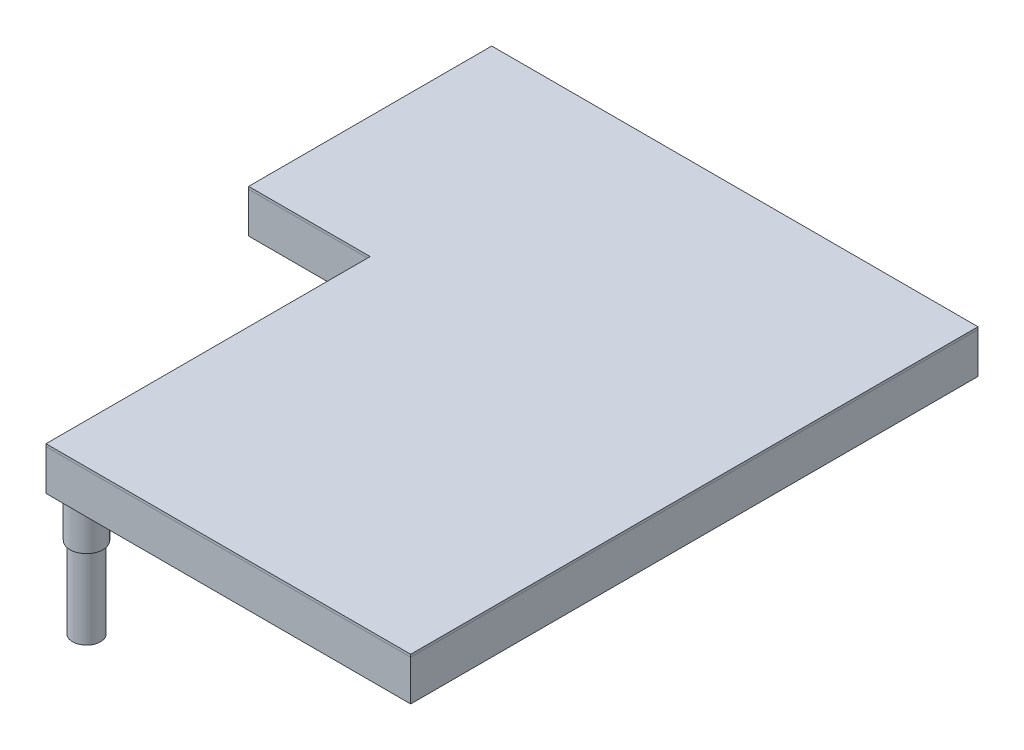
ISO-10303-21;
HEADER;
FILE_DESCRIPTION(('STEP AP214'),'2;1');
FILE_NAME('part.step','',(''),(''),'','','');
FILE_SCHEMA(('AUTOMOTIVE_DESIGN { 1 0 10303 214 1 1 1 1 }'));
ENDSEC;
DATA;
#1=APPLICATION_CONTEXT('core data for automotive mechanical design processes');
#2=APPLICATION_PROTOCOL_DEFINITION('international standard','automotive_design',2000,#1);
#3=PRODUCT_CONTEXT('',#1,'mechanical');
#4=PRODUCT('Part','Part','',(#3));
#5=PRODUCT_RELATED_PRODUCT_CATEGORY('part','',(#4));
#6=PRODUCT_DEFINITION_FORMATION('','',#4);
#7=PRODUCT_DEFINITION_CONTEXT('part definition',#1,'design');
#8=PRODUCT_DEFINITION('design','',#6,#7);
#9=PRODUCT_DEFINITION_SHAPE('','',#8);
#10=(LENGTH_UNIT() NAMED_UNIT(*) SI_UNIT(.MILLI.,.METRE.));
#11=(NAMED_UNIT(*) PLANE_ANGLE_UNIT() SI_UNIT($,.RADIAN.));
#12=(NAMED_UNIT(*) SI_UNIT($,.STERADIAN.) SOLID_ANGLE_UNIT());
#13=UNCERTAINTY_MEASURE_WITH_UNIT(LENGTH_MEASURE(1.E-05),#10,'distance_accuracy_value','');
#14=(GEOMETRIC_REPRESENTATION_CONTEXT(3) GLOBAL_UNCERTAINTY_ASSIGNED_CONTEXT((#13)) GLOBAL_UNIT_ASSIGNED_CONTEXT((#10,
#11,#12)) REPRESENTATION_CONTEXT('',''));
#15=CARTESIAN_POINT('',(0.,0.,0.));
#16=DIRECTION('',(0.,0.,1.));
#17=DIRECTION('',(1.,0.,0.));
#18=AXIS2_PLACEMENT_3D('',#15,#16,#17);
#19=CARTESIAN_POINT('',(25.4,-103.1875,-25.4));
#20=DIRECTION('',(0.,-1.,0.));
#21=DIRECTION('',(0.,0.,-1.));
#22=AXIS2_PLACEMENT_3D('',#19,#20,#21);
#23=PLANE('',#22);
#24=CARTESIAN_POINT('',(25.4,-103.1875,-25.4));
#25=DIRECTION('',(0.,-1.,0.));
#26=DIRECTION('',(0.,0.,-1.));
#27=AXIS2_PLACEMENT_3D('',#24,#25,#26);
#28=CIRCLE('',#27,20.6375);
#29=CARTESIAN_POINT('',(25.4,-103.1875,-46.0375));
#30=VERTEX_POINT('',#29);
#31=EDGE_CURVE('E11',#30,#30,#28,.T.);
#32=ORIENTED_EDGE('',*,*,#31,.T.);
#33=EDGE_LOOP('',(#32));
#34=FACE_BOUND('',#33,.T.);
#35=CARTESIAN_POINT('',(25.4,-103.1875,-25.4));
#36=DIRECTION('',(0.,-1.,0.));
#37=DIRECTION('',(0.,0.,-1.));
#38=AXIS2_PLACEMENT_3D('',#35,#36,#37);
#39=CIRCLE('',#38,17.4625);
#40=CARTESIAN_POINT('',(25.4,-103.1875,-42.8625));
#41=VERTEX_POINT('',#40);
#42=EDGE_CURVE('E53',#41,#41,#39,.T.);
#43=ORIENTED_EDGE('',*,*,#42,.F.);
#44=EDGE_LOOP('',(#43));
#45=FACE_BOUND('',#44,.T.);
#46=ADVANCED_FACE('F42',(#34,#45),#23,.T.);
#47=CARTESIAN_POINT('',(25.4,-52.3875,-25.4));
#48=DIRECTION('',(0.,-1.,0.));
#49=DIRECTION('',(0.,0.,-1.));
#50=AXIS2_PLACEMENT_3D('',#47,#48,#49);
#51=PLANE('',#50);
#52=CARTESIAN_POINT('',(25.4,-52.3875,-25.4));
#53=DIRECTION('',(0.,-1.,0.));
#54=DIRECTION('',(0.,0.,-1.));
#55=AXIS2_PLACEMENT_3D('',#52,#53,#54);
#56=CIRCLE('',#55,20.6375);
#57=CARTESIAN_POINT('',(25.4,-52.3875,-46.0375));
#58=VERTEX_POINT('',#57);
#59=EDGE_CURVE('E46',#58,#58,#56,.T.);
#60=ORIENTED_EDGE('',*,*,#59,.F.);
#61=EDGE_LOOP('',(#60));
#62=FACE_BOUND('',#61,.T.);
#63=CARTESIAN_POINT('',(25.4,-52.3875,-25.4));
#64=DIRECTION('',(0.,-1.,0.));
#65=DIRECTION('',(0.,0.,-1.));
#66=AXIS2_PLACEMENT_3D('',#63,#64,#65);
#67=CIRCLE('',#66,17.4625);
#68=CARTESIAN_POINT('',(25.4,-52.3875,-42.8625));
#69=VERTEX_POINT('',#68);
#70=EDGE_CURVE('E55',#69,#69,#67,.T.);
#71=ORIENTED_EDGE('',*,*,#70,.T.);
#72=EDGE_LOOP('',(#71));
#73=FACE_BOUND('',#72,.T.);
#74=ADVANCED_FACE('F65',(#62,#73),#51,.F.);
#75=CARTESIAN_POINT('',(25.4,-103.1875,-25.4));
#76=DIRECTION('',(0.,1.,0.));
#77=DIRECTION('',(0.,0.,1.));
#78=AXIS2_PLACEMENT_3D('',#75,#76,#77);
#79=CYLINDRICAL_SURFACE('',#78,20.6375);
#80=ORIENTED_EDGE('',*,*,#31,.F.);
#81=EDGE_LOOP('',(#80));
#82=FACE_BOUND('',#81,.T.);
#83=ORIENTED_EDGE('',*,*,#59,.T.);
#84=EDGE_LOOP('',(#83));
#85=FACE_BOUND('',#84,.T.);
#86=ADVANCED_FACE('F44',(#82,#85),#79,.T.);
#87=CARTESIAN_POINT('',(25.4,-103.1875,-25.4));
#88=DIRECTION('',(0.,1.,0.));
#89=DIRECTION('',(0.,0.,1.));
#90=AXIS2_PLACEMENT_3D('',#87,#88,#89);
#91=CYLINDRICAL_SURFACE('',#90,17.4625);
#92=ORIENTED_EDGE('',*,*,#42,.T.);
#93=EDGE_LOOP('',(#92));
#94=FACE_BOUND('',#93,.T.);
#95=ORIENTED_EDGE('',*,*,#70,.F.);
#96=EDGE_LOOP('',(#95));
#97=FACE_BOUND('',#96,.T.);
#98=ADVANCED_FACE('F61',(#94,#97),#91,.F.);
#99=CLOSED_SHELL('',(#46,#74,#86,#98));
#100=MANIFOLD_SOLID_BREP('B2',#99);
#101=CARTESIAN_POINT('',(0.,-52.3875,0.));
#102=DIRECTION('',(0.,-1.,0.));
#103=DIRECTION('',(0.,0.,-1.));
#104=AXIS2_PLACEMENT_3D('',#101,#102,#103);
#105=PLANE('',#104);
#106=DIRECTION('',(-1.,0.,0.));
#107=VECTOR('',#106,1.);
#108=CARTESIAN_POINT('',(406.4,-52.3875,-50.8));
#109=LINE('',#108,#107);
#110=CARTESIAN_POINT('',(406.4,-52.3875,-50.8));
#111=VERTEX_POINT('',#110);
#112=CARTESIAN_POINT('',(50.8,-52.3875,-50.8));
#113=VERTEX_POINT('',#112);
#114=EDGE_CURVE('E210',#111,#113,#109,.T.);
#115=ORIENTED_EDGE('',*,*,#114,.F.);
#116=DIRECTION('',(0.,0.,1.));
#117=VECTOR('',#116,1.);
#118=CARTESIAN_POINT('',(406.4,-52.3875,-660.4));
#119=LINE('',#118,#117);
#120=CARTESIAN_POINT('',(406.4,-52.3875,-660.4));
#121=VERTEX_POINT('',#120);
#122=EDGE_CURVE('E202',#121,#111,#119,.T.);
#123=ORIENTED_EDGE('',*,*,#122,.F.);
#124=DIRECTION('',(1.,0.,0.));
#125=VECTOR('',#124,1.);
#126=CARTESIAN_POINT('',(-101.6,-52.3875,-660.4));
#127=LINE('',#126,#125);
#128=CARTESIAN_POINT('',(-101.6,-52.3875,-660.4));
#129=VERTEX_POINT('',#128);
#130=EDGE_CURVE('E233',#129,#121,#127,.T.);
#131=ORIENTED_EDGE('',*,*,#130,.F.);
#132=DIRECTION('',(0.,0.,-1.));
#133=VECTOR('',#132,1.);
#134=CARTESIAN_POINT('',(-101.6,-52.3875,-457.2));
#135=LINE('',#134,#133);
#136=CARTESIAN_POINT('',(-101.6,-52.3875,-457.2));
#137=VERTEX_POINT('',#136);
#138=EDGE_CURVE('E231',#137,#129,#135,.T.);
#139=ORIENTED_EDGE('',*,*,#138,.F.);
#140=DIRECTION('',(-1.,0.,0.));
#141=VECTOR('',#140,1.);
#142=CARTESIAN_POINT('',(50.8000000000001,-52.3875,-457.2));
#143=LINE('',#142,#141);
#144=CARTESIAN_POINT('',(50.8000000000001,-52.3875,-457.2));
#145=VERTEX_POINT('',#144);
#146=EDGE_CURVE('E226',#145,#137,#143,.T.);
#147=ORIENTED_EDGE('',*,*,#146,.F.);
#148=DIRECTION('',(0.,0.,-1.));
#149=VECTOR('',#148,1.);
#150=CARTESIAN_POINT('',(50.8,-52.3875,-50.8));
#151=LINE('',#150,#149);
#152=EDGE_CURVE('E224',#113,#145,#151,.T.);
#153=ORIENTED_EDGE('',*,*,#152,.F.);
#154=EDGE_LOOP('',(#115,#123,#131,#139,#147,#153));
#155=FACE_BOUND('',#154,.T.);
#156=DIRECTION('',(0.,0.,1.));
#157=VECTOR('',#156,1.);
#158=CARTESIAN_POINT('',(457.2,-52.3875,-711.2));
#159=LINE('',#158,#157);
#160=CARTESIAN_POINT('',(457.2,-52.3875,-711.2));
#161=VERTEX_POINT('',#160);
#162=CARTESIAN_POINT('',(457.2,-52.3875,0.));
#163=VERTEX_POINT('',#162);
#164=EDGE_CURVE('E256',#161,#163,#159,.T.);
#165=ORIENTED_EDGE('',*,*,#164,.T.);
#166=DIRECTION('',(-1.,0.,0.));
#167=VECTOR('',#166,1.);
#168=CARTESIAN_POINT('',(457.2,-52.3875,0.));
#169=LINE('',#168,#167);
#170=CARTESIAN_POINT('',(0.,-52.3875,0.));
#171=VERTEX_POINT('',#170);
#172=EDGE_CURVE('E259',#163,#171,#169,.T.);
#173=ORIENTED_EDGE('',*,*,#172,.T.);
#174=DIRECTION('',(0.,0.,-1.));
#175=VECTOR('',#174,1.);
#176=CARTESIAN_POINT('',(0.,-52.3875,0.));
#177=LINE('',#176,#175);
#178=CARTESIAN_POINT('',(0.,-52.3875,-406.4));
#179=VERTEX_POINT('',#178);
#180=EDGE_CURVE('E262',#171,#179,#177,.T.);
#181=ORIENTED_EDGE('',*,*,#180,.T.);
#182=DIRECTION('',(-1.,0.,0.));
#183=VECTOR('',#182,1.);
#184=CARTESIAN_POINT('',(0.,-52.3875,-406.4));
#185=LINE('',#184,#183);
#186=CARTESIAN_POINT('',(-152.4,-52.3875,-406.4));
#187=VERTEX_POINT('',#186);
#188=EDGE_CURVE('E264',#179,#187,#185,.T.);
#189=ORIENTED_EDGE('',*,*,#188,.T.);
#190=DIRECTION('',(0.,0.,-1.));
#191=VECTOR('',#190,1.);
#192=CARTESIAN_POINT('',(-152.4,-52.3875,-406.4));
#193=LINE('',#192,#191);
#194=CARTESIAN_POINT('',(-152.4,-52.3875,-711.2));
#195=VERTEX_POINT('',#194);
#196=EDGE_CURVE('E266',#187,#195,#193,.T.);
#197=ORIENTED_EDGE('',*,*,#196,.T.);
#198=DIRECTION('',(1.,0.,0.));
#199=VECTOR('',#198,1.);
#200=CARTESIAN_POINT('',(-152.4,-52.3875,-711.2));
#201=LINE('',#200,#199);
#202=EDGE_CURVE('E268',#195,#161,#201,.T.);
#203=ORIENTED_EDGE('',*,*,#202,.T.);
#204=EDGE_LOOP('',(#165,#173,#181,#189,#197,#203));
#205=FACE_BOUND('',#204,.T.);
#206=CARTESIAN_POINT('',(25.4,-52.3875,-25.4));
#207=DIRECTION('',(0.,-1.,0.));
#208=DIRECTION('',(0.,0.,-1.));
#209=AXIS2_PLACEMENT_3D('',#206,#207,#208);
#210=CIRCLE('',#209,17.4625);
#211=CARTESIAN_POINT('',(25.4,-52.3875,-42.8625));
#212=VERTEX_POINT('',#211);
#213=EDGE_CURVE('E367',#212,#212,#210,.T.);
#214=ORIENTED_EDGE('',*,*,#213,.F.);
#215=EDGE_LOOP('',(#214));
#216=FACE_BOUND('',#215,.T.);
#217=ADVANCED_FACE('F113',(#155,#205,#216),#105,.T.);
#218=CARTESIAN_POINT('',(0.,-1.5875,0.));
#219=DIRECTION('',(0.,-1.,0.));
#220=DIRECTION('',(0.,0.,-1.));
#221=AXIS2_PLACEMENT_3D('',#218,#219,#220);
#222=PLANE('',#221);
#223=DIRECTION('',(0.,0.,1.));
#224=VECTOR('',#223,1.);
#225=CARTESIAN_POINT('',(457.2,-1.5875,-711.2));
#226=LINE('',#225,#224);
#227=CARTESIAN_POINT('',(457.2,-1.5875,-711.2));
#228=VERTEX_POINT('',#227);
#229=CARTESIAN_POINT('',(457.2,-1.5875,0.));
#230=VERTEX_POINT('',#229);
#231=EDGE_CURVE('E218',#228,#230,#226,.T.);
#232=ORIENTED_EDGE('',*,*,#231,.F.);
#233=DIRECTION('',(1.,0.,0.));
#234=VECTOR('',#233,1.);
#235=CARTESIAN_POINT('',(-152.4,-1.5875,-711.2));
#236=LINE('',#235,#234);
#237=CARTESIAN_POINT('',(-152.4,-1.5875,-711.2));
#238=VERTEX_POINT('',#237);
#239=EDGE_CURVE('E260',#238,#228,#236,.T.);
#240=ORIENTED_EDGE('',*,*,#239,.F.);
#241=DIRECTION('',(0.,0.,-1.));
#242=VECTOR('',#241,1.);
#243=CARTESIAN_POINT('',(-152.4,-1.5875,-406.4));
#244=LINE('',#243,#242);
#245=CARTESIAN_POINT('',(-152.4,-1.5875,-406.4));
#246=VERTEX_POINT('',#245);
#247=EDGE_CURVE('E279',#246,#238,#244,.T.);
#248=ORIENTED_EDGE('',*,*,#247,.F.);
#249=DIRECTION('',(-1.,0.,0.));
#250=VECTOR('',#249,1.);
#251=CARTESIAN_POINT('',(0.,-1.5875,-406.4));
#252=LINE('',#251,#250);
#253=CARTESIAN_POINT('',(0.,-1.5875,-406.4));
#254=VERTEX_POINT('',#253);
#255=EDGE_CURVE('E277',#254,#246,#252,.T.);
#256=ORIENTED_EDGE('',*,*,#255,.F.);
#257=DIRECTION('',(0.,0.,-1.));
#258=VECTOR('',#257,1.);
#259=CARTESIAN_POINT('',(0.,-1.5875,0.));
#260=LINE('',#259,#258);
#261=CARTESIAN_POINT('',(0.,-1.5875,0.));
#262=VERTEX_POINT('',#261);
#263=EDGE_CURVE('E275',#262,#254,#260,.T.);
#264=ORIENTED_EDGE('',*,*,#263,.F.);
#265=DIRECTION('',(-1.,0.,0.));
#266=VECTOR('',#265,1.);
#267=CARTESIAN_POINT('',(457.2,-1.5875,0.));
#268=LINE('',#267,#266);
#269=EDGE_CURVE('E273',#230,#262,#268,.T.);
#270=ORIENTED_EDGE('',*,*,#269,.F.);
#271=EDGE_LOOP('',(#232,#240,#248,#256,#264,#270));
#272=FACE_BOUND('',#271,.T.);
#273=DIRECTION('',(0.,0.,1.));
#274=VECTOR('',#273,1.);
#275=CARTESIAN_POINT('',(406.4,-1.5875,-660.4));
#276=LINE('',#275,#274);
#277=CARTESIAN_POINT('',(406.4,-1.5875,-660.4));
#278=VERTEX_POINT('',#277);
#279=CARTESIAN_POINT('',(406.4,-1.5875,-50.8));
#280=VERTEX_POINT('',#279);
#281=EDGE_CURVE('E136',#278,#280,#276,.T.);
#282=ORIENTED_EDGE('',*,*,#281,.T.);
#283=DIRECTION('',(-1.,0.,0.));
#284=VECTOR('',#283,1.);
#285=CARTESIAN_POINT('',(406.4,-1.5875,-50.8));
#286=LINE('',#285,#284);
#287=CARTESIAN_POINT('',(50.8,-1.5875,-50.8));
#288=VERTEX_POINT('',#287);
#289=EDGE_CURVE('E217',#280,#288,#286,.T.);
#290=ORIENTED_EDGE('',*,*,#289,.T.);
#291=DIRECTION('',(0.,0.,-1.));
#292=VECTOR('',#291,1.);
#293=CARTESIAN_POINT('',(50.8,-1.5875,-50.8));
#294=LINE('',#293,#292);
#295=CARTESIAN_POINT('',(50.8000000000001,-1.5875,-457.2));
#296=VERTEX_POINT('',#295);
#297=EDGE_CURVE('E238',#288,#296,#294,.T.);
#298=ORIENTED_EDGE('',*,*,#297,.T.);
#299=DIRECTION('',(-1.,0.,0.));
#300=VECTOR('',#299,1.);
#301=CARTESIAN_POINT('',(50.8000000000001,-1.5875,-457.2));
#302=LINE('',#301,#300);
#303=CARTESIAN_POINT('',(-101.6,-1.5875,-457.2));
#304=VERTEX_POINT('',#303);
#305=EDGE_CURVE('E241',#296,#304,#302,.T.);
#306=ORIENTED_EDGE('',*,*,#305,.T.);
#307=DIRECTION('',(0.,0.,-1.));
#308=VECTOR('',#307,1.);
#309=CARTESIAN_POINT('',(-101.6,-1.5875,-457.2));
#310=LINE('',#309,#308);
#311=CARTESIAN_POINT('',(-101.6,-1.5875,-660.4));
#312=VERTEX_POINT('',#311);
#313=EDGE_CURVE('E244',#304,#312,#310,.T.);
#314=ORIENTED_EDGE('',*,*,#313,.T.);
#315=DIRECTION('',(1.,0.,0.));
#316=VECTOR('',#315,1.);
#317=CARTESIAN_POINT('',(-101.6,-1.5875,-660.4));
#318=LINE('',#317,#316);
#319=EDGE_CURVE('E211',#312,#278,#318,.T.);
#320=ORIENTED_EDGE('',*,*,#319,.T.);
#321=EDGE_LOOP('',(#282,#290,#298,#306,#314,#320));
#322=FACE_BOUND('',#321,.T.);
#323=ADVANCED_FACE('F303',(#272,#322),#222,.F.);
#324=CARTESIAN_POINT('',(457.2,-52.3875,-711.2));
#325=DIRECTION('',(-1.,0.,0.));
#326=DIRECTION('',(0.,0.,1.));
#327=AXIS2_PLACEMENT_3D('',#324,#325,#326);
#328=PLANE('',#327);
#329=ORIENTED_EDGE('',*,*,#231,.T.);
#330=DIRECTION('',(0.,1.,0.));
#331=VECTOR('',#330,1.);
#332=CARTESIAN_POINT('',(457.2,-52.3875,0.));
#333=LINE('',#332,#331);
#334=EDGE_CURVE('E40',#163,#230,#333,.T.);
#335=ORIENTED_EDGE('',*,*,#334,.F.);
#336=ORIENTED_EDGE('',*,*,#164,.F.);
#337=DIRECTION('',(0.,1.,0.));
#338=VECTOR('',#337,1.);
#339=CARTESIAN_POINT('',(457.2,-52.3875,-711.2));
#340=LINE('',#339,#338);
#341=EDGE_CURVE('E270',#161,#228,#340,.T.);
#342=ORIENTED_EDGE('',*,*,#341,.T.);
#343=EDGE_LOOP('',(#329,#335,#336,#342));
#344=FACE_BOUND('',#343,.T.);
#345=ADVANCED_FACE('F115',(#344),#328,.F.);
#346=CARTESIAN_POINT('',(457.2,-52.3875,0.));
#347=DIRECTION('',(0.,0.,-1.));
#348=DIRECTION('',(-1.,0.,0.));
#349=AXIS2_PLACEMENT_3D('',#346,#347,#348);
#350=PLANE('',#349);
#351=ORIENTED_EDGE('',*,*,#269,.T.);
#352=DIRECTION('',(0.,1.,0.));
#353=VECTOR('',#352,1.);
#354=CARTESIAN_POINT('',(0.,-52.3875,0.));
#355=LINE('',#354,#353);
#356=EDGE_CURVE('E121',#171,#262,#355,.T.);
#357=ORIENTED_EDGE('',*,*,#356,.F.);
#358=ORIENTED_EDGE('',*,*,#172,.F.);
#359=ORIENTED_EDGE('',*,*,#334,.T.);
#360=EDGE_LOOP('',(#351,#357,#358,#359));
#361=FACE_BOUND('',#360,.T.);
#362=ADVANCED_FACE('F320',(#361),#350,.F.);
#363=CARTESIAN_POINT('',(0.,-52.3875,0.));
#364=DIRECTION('',(1.,0.,0.));
#365=DIRECTION('',(0.,0.,-1.));
#366=AXIS2_PLACEMENT_3D('',#363,#364,#365);
#367=PLANE('',#366);
#368=ORIENTED_EDGE('',*,*,#263,.T.);
#369=DIRECTION('',(0.,1.,0.));
#370=VECTOR('',#369,1.);
#371=CARTESIAN_POINT('',(0.,-52.3875,-406.4));
#372=LINE('',#371,#370);
#373=EDGE_CURVE('E290',#179,#254,#372,.T.);
#374=ORIENTED_EDGE('',*,*,#373,.F.);
#375=ORIENTED_EDGE('',*,*,#180,.F.);
#376=ORIENTED_EDGE('',*,*,#356,.T.);
#377=EDGE_LOOP('',(#368,#374,#375,#376));
#378=FACE_BOUND('',#377,.T.);
#379=ADVANCED_FACE('F297',(#378),#367,.F.);
#380=CARTESIAN_POINT('',(0.,-52.3875,-406.4));
#381=DIRECTION('',(0.,0.,-1.));
#382=DIRECTION('',(-1.,0.,0.));
#383=AXIS2_PLACEMENT_3D('',#380,#381,#382);
#384=PLANE('',#383);
#385=ORIENTED_EDGE('',*,*,#255,.T.);
#386=DIRECTION('',(0.,1.,0.));
#387=VECTOR('',#386,1.);
#388=CARTESIAN_POINT('',(-152.4,-52.3875,-406.4));
#389=LINE('',#388,#387);
#390=EDGE_CURVE('E287',#187,#246,#389,.T.);
#391=ORIENTED_EDGE('',*,*,#390,.F.);
#392=ORIENTED_EDGE('',*,*,#188,.F.);
#393=ORIENTED_EDGE('',*,*,#373,.T.);
#394=EDGE_LOOP('',(#385,#391,#392,#393));
#395=FACE_BOUND('',#394,.T.);
#396=ADVANCED_FACE('F309',(#395),#384,.F.);
#397=CARTESIAN_POINT('',(-152.4,-52.3875,-406.4));
#398=DIRECTION('',(1.,0.,0.));
#399=DIRECTION('',(0.,0.,-1.));
#400=AXIS2_PLACEMENT_3D('',#397,#398,#399);
#401=PLANE('',#400);
#402=ORIENTED_EDGE('',*,*,#247,.T.);
#403=DIRECTION('',(0.,1.,0.));
#404=VECTOR('',#403,1.);
#405=CARTESIAN_POINT('',(-152.4,-52.3875,-711.2));
#406=LINE('',#405,#404);
#407=EDGE_CURVE('E284',#195,#238,#406,.T.);
#408=ORIENTED_EDGE('',*,*,#407,.F.);
#409=ORIENTED_EDGE('',*,*,#196,.F.);
#410=ORIENTED_EDGE('',*,*,#390,.T.);
#411=EDGE_LOOP('',(#402,#408,#409,#410));
#412=FACE_BOUND('',#411,.T.);
#413=ADVANCED_FACE('F313',(#412),#401,.F.);
#414=CARTESIAN_POINT('',(-152.4,-52.3875,-711.2));
#415=DIRECTION('',(0.,0.,1.));
#416=DIRECTION('',(1.,0.,0.));
#417=AXIS2_PLACEMENT_3D('',#414,#415,#416);
#418=PLANE('',#417);
#419=ORIENTED_EDGE('',*,*,#239,.T.);
#420=ORIENTED_EDGE('',*,*,#341,.F.);
#421=ORIENTED_EDGE('',*,*,#202,.F.);
#422=ORIENTED_EDGE('',*,*,#407,.T.);
#423=EDGE_LOOP('',(#419,#420,#421,#422));
#424=FACE_BOUND('',#423,.T.);
#425=ADVANCED_FACE('F323',(#424),#418,.F.);
#426=CARTESIAN_POINT('',(406.4,-52.3875,-660.4));
#427=DIRECTION('',(-1.,0.,0.));
#428=DIRECTION('',(0.,0.,1.));
#429=AXIS2_PLACEMENT_3D('',#426,#427,#428);
#430=PLANE('',#429);
#431=ORIENTED_EDGE('',*,*,#281,.F.);
#432=DIRECTION('',(0.,1.,0.));
#433=VECTOR('',#432,1.);
#434=CARTESIAN_POINT('',(406.4,-52.3875,-660.4));
#435=LINE('',#434,#433);
#436=EDGE_CURVE('E206',#121,#278,#435,.T.);
#437=ORIENTED_EDGE('',*,*,#436,.F.);
#438=ORIENTED_EDGE('',*,*,#122,.T.);
#439=DIRECTION('',(0.,1.,0.));
#440=VECTOR('',#439,1.);
#441=CARTESIAN_POINT('',(406.4,-52.3875,-50.8));
#442=LINE('',#441,#440);
#443=EDGE_CURVE('E205',#111,#280,#442,.T.);
#444=ORIENTED_EDGE('',*,*,#443,.T.);
#445=EDGE_LOOP('',(#431,#437,#438,#444));
#446=FACE_BOUND('',#445,.T.);
#447=ADVANCED_FACE('F204',(#446),#430,.T.);
#448=CARTESIAN_POINT('',(406.4,-52.3875,-50.8));
#449=DIRECTION('',(0.,0.,-1.));
#450=DIRECTION('',(-1.,0.,0.));
#451=AXIS2_PLACEMENT_3D('',#448,#449,#450);
#452=PLANE('',#451);
#453=ORIENTED_EDGE('',*,*,#289,.F.);
#454=ORIENTED_EDGE('',*,*,#443,.F.);
#455=ORIENTED_EDGE('',*,*,#114,.T.);
#456=DIRECTION('',(0.,1.,0.));
#457=VECTOR('',#456,1.);
#458=CARTESIAN_POINT('',(50.8,-52.3875,-50.8));
#459=LINE('',#458,#457);
#460=EDGE_CURVE('E219',#113,#288,#459,.T.);
#461=ORIENTED_EDGE('',*,*,#460,.T.);
#462=EDGE_LOOP('',(#453,#454,#455,#461));
#463=FACE_BOUND('',#462,.T.);
#464=ADVANCED_FACE('F214',(#463),#452,.T.);
#465=CARTESIAN_POINT('',(50.8,-52.3875,-50.8));
#466=DIRECTION('',(1.,0.,0.));
#467=DIRECTION('',(0.,0.,-1.));
#468=AXIS2_PLACEMENT_3D('',#465,#466,#467);
#469=PLANE('',#468);
#470=ORIENTED_EDGE('',*,*,#297,.F.);
#471=ORIENTED_EDGE('',*,*,#460,.F.);
#472=ORIENTED_EDGE('',*,*,#152,.T.);
#473=DIRECTION('',(0.,1.,0.));
#474=VECTOR('',#473,1.);
#475=CARTESIAN_POINT('',(50.8000000000001,-52.3875,-457.2));
#476=LINE('',#475,#474);
#477=EDGE_CURVE('E253',#145,#296,#476,.T.);
#478=ORIENTED_EDGE('',*,*,#477,.T.);
#479=EDGE_LOOP('',(#470,#471,#472,#478));
#480=FACE_BOUND('',#479,.T.);
#481=ADVANCED_FACE('F341',(#480),#469,.T.);
#482=CARTESIAN_POINT('',(50.8000000000001,-52.3875,-457.2));
#483=DIRECTION('',(0.,0.,-1.));
#484=DIRECTION('',(-1.,0.,0.));
#485=AXIS2_PLACEMENT_3D('',#482,#483,#484);
#486=PLANE('',#485);
#487=ORIENTED_EDGE('',*,*,#305,.F.);
#488=ORIENTED_EDGE('',*,*,#477,.F.);
#489=ORIENTED_EDGE('',*,*,#146,.T.);
#490=DIRECTION('',(0.,1.,0.));
#491=VECTOR('',#490,1.);
#492=CARTESIAN_POINT('',(-101.6,-52.3875,-457.2));
#493=LINE('',#492,#491);
#494=EDGE_CURVE('E251',#137,#304,#493,.T.);
#495=ORIENTED_EDGE('',*,*,#494,.T.);
#496=EDGE_LOOP('',(#487,#488,#489,#495));
#497=FACE_BOUND('',#496,.T.);
#498=ADVANCED_FACE('F344',(#497),#486,.T.);
#499=CARTESIAN_POINT('',(-101.6,-52.3875,-457.2));
#500=DIRECTION('',(1.,0.,0.));
#501=DIRECTION('',(0.,0.,-1.));
#502=AXIS2_PLACEMENT_3D('',#499,#500,#501);
#503=PLANE('',#502);
#504=ORIENTED_EDGE('',*,*,#313,.F.);
#505=ORIENTED_EDGE('',*,*,#494,.F.);
#506=ORIENTED_EDGE('',*,*,#138,.T.);
#507=DIRECTION('',(0.,1.,0.));
#508=VECTOR('',#507,1.);
#509=CARTESIAN_POINT('',(-101.6,-52.3875,-660.4));
#510=LINE('',#509,#508);
#511=EDGE_CURVE('E128',#129,#312,#510,.T.);
#512=ORIENTED_EDGE('',*,*,#511,.T.);
#513=EDGE_LOOP('',(#504,#505,#506,#512));
#514=FACE_BOUND('',#513,.T.);
#515=ADVANCED_FACE('F348',(#514),#503,.T.);
#516=CARTESIAN_POINT('',(-101.6,-52.3875,-660.4));
#517=DIRECTION('',(0.,0.,1.));
#518=DIRECTION('',(1.,0.,0.));
#519=AXIS2_PLACEMENT_3D('',#516,#517,#518);
#520=PLANE('',#519);
#521=ORIENTED_EDGE('',*,*,#319,.F.);
#522=ORIENTED_EDGE('',*,*,#511,.F.);
#523=ORIENTED_EDGE('',*,*,#130,.T.);
#524=ORIENTED_EDGE('',*,*,#436,.T.);
#525=EDGE_LOOP('',(#521,#522,#523,#524));
#526=FACE_BOUND('',#525,.T.);
#527=ADVANCED_FACE('F352',(#526),#520,.T.);
#528=CARTESIAN_POINT('',(25.4,-204.7875,-25.4));
#529=DIRECTION('',(0.,1.,0.));
#530=DIRECTION('',(0.,0.,1.));
#531=AXIS2_PLACEMENT_3D('',#528,#529,#530);
#532=CYLINDRICAL_SURFACE('',#531,17.4625);
#533=CARTESIAN_POINT('',(25.4,-204.7875,-25.4));
#534=DIRECTION('',(0.,-1.,0.));
#535=DIRECTION('',(0.,0.,-1.));
#536=AXIS2_PLACEMENT_3D('',#533,#534,#535);
#537=CIRCLE('',#536,17.4625);
#538=CARTESIAN_POINT('',(25.4,-204.7875,-42.8625));
#539=VERTEX_POINT('',#538);
#540=EDGE_CURVE('E236',#539,#539,#537,.T.);
#541=ORIENTED_EDGE('',*,*,#540,.F.);
#542=EDGE_LOOP('',(#541));
#543=FACE_BOUND('',#542,.T.);
#544=ORIENTED_EDGE('',*,*,#213,.T.);
#545=EDGE_LOOP('',(#544));
#546=FACE_BOUND('',#545,.T.);
#547=ADVANCED_FACE('F356',(#543,#546),#532,.T.);
#548=CARTESIAN_POINT('',(25.4,-204.7875,-25.4));
#549=DIRECTION('',(0.,-1.,0.));
#550=DIRECTION('',(0.,0.,-1.));
#551=AXIS2_PLACEMENT_3D('',#548,#549,#550);
#552=PLANE('',#551);
#553=ORIENTED_EDGE('',*,*,#540,.T.);
#554=EDGE_LOOP('',(#553));
#555=FACE_BOUND('',#554,.T.);
#556=ADVANCED_FACE('F359',(#555),#552,.T.);
#557=CLOSED_SHELL('',(#217,#323,#345,#362,#379,#396,#413,#425,#447,#464,#481,#498,#515,#527,
#547,#556));
#558=MANIFOLD_SOLID_BREP('B6',#557);
#559=CARTESIAN_POINT('',(457.2,1.5875,0.));
#560=DIRECTION('',(0.,0.,-1.));
#561=DIRECTION('',(-1.,0.,0.));
#562=AXIS2_PLACEMENT_3D('',#559,#560,#561);
#563=PLANE('',#562);
#564=DIRECTION('',(1.,0.,0.));
#565=VECTOR('',#564,1.);
#566=CARTESIAN_POINT('',(457.2,-1.5875,0.));
#567=LINE('',#566,#565);
#568=CARTESIAN_POINT('',(0.,-1.5875,0.));
#569=VERTEX_POINT('',#568);
#570=CARTESIAN_POINT('',(457.2,-1.5875,0.));
#571=VERTEX_POINT('',#570);
#572=EDGE_CURVE('E561',#569,#571,#567,.T.);
#573=ORIENTED_EDGE('',*,*,#572,.T.);
#574=DIRECTION('',(0.,-1.,0.));
#575=VECTOR('',#574,1.);
#576=CARTESIAN_POINT('',(457.2,1.5875,0.));
#577=LINE('',#576,#575);
#578=CARTESIAN_POINT('',(457.2,1.5875,0.));
#579=VERTEX_POINT('',#578);
#580=EDGE_CURVE('E111',#579,#571,#577,.T.);
#581=ORIENTED_EDGE('',*,*,#580,.F.);
#582=DIRECTION('',(1.,0.,0.));
#583=VECTOR('',#582,1.);
#584=CARTESIAN_POINT('',(457.2,1.5875,0.));
#585=LINE('',#584,#583);
#586=CARTESIAN_POINT('',(0.,1.5875,0.));
#587=VERTEX_POINT('',#586);
#588=EDGE_CURVE('E571',#587,#579,#585,.T.);
#589=ORIENTED_EDGE('',*,*,#588,.F.);
#590=DIRECTION('',(0.,-1.,0.));
#591=VECTOR('',#590,1.);
#592=CARTESIAN_POINT('',(0.,1.5875,0.));
#593=LINE('',#592,#591);
#594=EDGE_CURVE('E557',#587,#569,#593,.T.);
#595=ORIENTED_EDGE('',*,*,#594,.T.);
#596=EDGE_LOOP('',(#573,#581,#589,#595));
#597=FACE_BOUND('',#596,.T.);
#598=ADVANCED_FACE('F477',(#597),#563,.F.);
#599=CARTESIAN_POINT('',(457.2,1.5875,-711.2));
#600=DIRECTION('',(-1.,0.,0.));
#601=DIRECTION('',(0.,0.,1.));
#602=AXIS2_PLACEMENT_3D('',#599,#600,#601);
#603=PLANE('',#602);
#604=DIRECTION('',(0.,0.,-1.));
#605=VECTOR('',#604,1.);
#606=CARTESIAN_POINT('',(457.2,-1.5875,-711.2));
#607=LINE('',#606,#605);
#608=CARTESIAN_POINT('',(457.2,-1.5875,-711.2));
#609=VERTEX_POINT('',#608);
#610=EDGE_CURVE('E564',#571,#609,#607,.T.);
#611=ORIENTED_EDGE('',*,*,#610,.T.);
#612=DIRECTION('',(0.,-1.,0.));
#613=VECTOR('',#612,1.);
#614=CARTESIAN_POINT('',(457.2,1.5875,-711.2));
#615=LINE('',#614,#613);
#616=CARTESIAN_POINT('',(457.2,1.5875,-711.2));
#617=VERTEX_POINT('',#616);
#618=EDGE_CURVE('E485',#617,#609,#615,.T.);
#619=ORIENTED_EDGE('',*,*,#618,.F.);
#620=DIRECTION('',(0.,0.,-1.));
#621=VECTOR('',#620,1.);
#622=CARTESIAN_POINT('',(457.2,1.5875,-711.2));
#623=LINE('',#622,#621);
#624=EDGE_CURVE('E530',#579,#617,#623,.T.);
#625=ORIENTED_EDGE('',*,*,#624,.F.);
#626=ORIENTED_EDGE('',*,*,#580,.T.);
#627=EDGE_LOOP('',(#611,#619,#625,#626));
#628=FACE_BOUND('',#627,.T.);
#629=ADVANCED_FACE('F595',(#628),#603,.F.);
#630=CARTESIAN_POINT('',(-152.4,1.5875,-711.2));
#631=DIRECTION('',(0.,0.,1.));
#632=DIRECTION('',(1.,0.,0.));
#633=AXIS2_PLACEMENT_3D('',#630,#631,#632);
#634=PLANE('',#633);
#635=DIRECTION('',(-1.,0.,0.));
#636=VECTOR('',#635,1.);
#637=CARTESIAN_POINT('',(-152.4,-1.5875,-711.2));
#638=LINE('',#637,#636);
#639=CARTESIAN_POINT('',(-152.4,-1.5875,-711.2));
#640=VERTEX_POINT('',#639);
#641=EDGE_CURVE('E566',#609,#640,#638,.T.);
#642=ORIENTED_EDGE('',*,*,#641,.T.);
#643=DIRECTION('',(0.,-1.,0.));
#644=VECTOR('',#643,1.);
#645=CARTESIAN_POINT('',(-152.4,1.5875,-711.2));
#646=LINE('',#645,#644);
#647=CARTESIAN_POINT('',(-152.4,1.5875,-711.2));
#648=VERTEX_POINT('',#647);
#649=EDGE_CURVE('E552',#648,#640,#646,.T.);
#650=ORIENTED_EDGE('',*,*,#649,.F.);
#651=DIRECTION('',(-1.,0.,0.));
#652=VECTOR('',#651,1.);
#653=CARTESIAN_POINT('',(-152.4,1.5875,-711.2));
#654=LINE('',#653,#652);
#655=EDGE_CURVE('E543',#617,#648,#654,.T.);
#656=ORIENTED_EDGE('',*,*,#655,.F.);
#657=ORIENTED_EDGE('',*,*,#618,.T.);
#658=EDGE_LOOP('',(#642,#650,#656,#657));
#659=FACE_BOUND('',#658,.T.);
#660=ADVANCED_FACE('F577',(#659),#634,.F.);
#661=CARTESIAN_POINT('',(-152.4,1.5875,-406.4));
#662=DIRECTION('',(1.,0.,0.));
#663=DIRECTION('',(0.,0.,-1.));
#664=AXIS2_PLACEMENT_3D('',#661,#662,#663);
#665=PLANE('',#664);
#666=DIRECTION('',(0.,0.,1.));
#667=VECTOR('',#666,1.);
#668=CARTESIAN_POINT('',(-152.4,-1.5875,-406.4));
#669=LINE('',#668,#667);
#670=CARTESIAN_POINT('',(-152.4,-1.5875,-406.4));
#671=VERTEX_POINT('',#670);
#672=EDGE_CURVE('E551',#640,#671,#669,.T.);
#673=ORIENTED_EDGE('',*,*,#672,.T.);
#674=DIRECTION('',(0.,-1.,0.));
#675=VECTOR('',#674,1.);
#676=CARTESIAN_POINT('',(-152.4,1.5875,-406.4));
#677=LINE('',#676,#675);
#678=CARTESIAN_POINT('',(-152.4,1.5875,-406.4));
#679=VERTEX_POINT('',#678);
#680=EDGE_CURVE('E548',#679,#671,#677,.T.);
#681=ORIENTED_EDGE('',*,*,#680,.F.);
#682=DIRECTION('',(0.,0.,1.));
#683=VECTOR('',#682,1.);
#684=CARTESIAN_POINT('',(-152.4,1.5875,-406.4));
#685=LINE('',#684,#683);
#686=EDGE_CURVE('E537',#648,#679,#685,.T.);
#687=ORIENTED_EDGE('',*,*,#686,.F.);
#688=ORIENTED_EDGE('',*,*,#649,.T.);
#689=EDGE_LOOP('',(#673,#681,#687,#688));
#690=FACE_BOUND('',#689,.T.);
#691=ADVANCED_FACE('F549',(#690),#665,.F.);
#692=CARTESIAN_POINT('',(0.,1.5875,-406.4));
#693=DIRECTION('',(0.,0.,-1.));
#694=DIRECTION('',(-1.,0.,0.));
#695=AXIS2_PLACEMENT_3D('',#692,#693,#694);
#696=PLANE('',#695);
#697=DIRECTION('',(1.,0.,0.));
#698=VECTOR('',#697,1.);
#699=CARTESIAN_POINT('',(0.,-1.5875,-406.4));
#700=LINE('',#699,#698);
#701=CARTESIAN_POINT('',(0.,-1.5875,-406.4));
#702=VERTEX_POINT('',#701);
#703=EDGE_CURVE('E516',#671,#702,#700,.T.);
#704=ORIENTED_EDGE('',*,*,#703,.T.);
#705=DIRECTION('',(0.,-1.,0.));
#706=VECTOR('',#705,1.);
#707=CARTESIAN_POINT('',(0.,1.5875,-406.4));
#708=LINE('',#707,#706);
#709=CARTESIAN_POINT('',(0.,1.5875,-406.4));
#710=VERTEX_POINT('',#709);
#711=EDGE_CURVE('E553',#710,#702,#708,.T.);
#712=ORIENTED_EDGE('',*,*,#711,.F.);
#713=DIRECTION('',(1.,0.,0.));
#714=VECTOR('',#713,1.);
#715=CARTESIAN_POINT('',(0.,1.5875,-406.4));
#716=LINE('',#715,#714);
#717=EDGE_CURVE('E541',#679,#710,#716,.T.);
#718=ORIENTED_EDGE('',*,*,#717,.F.);
#719=ORIENTED_EDGE('',*,*,#680,.T.);
#720=EDGE_LOOP('',(#704,#712,#718,#719));
#721=FACE_BOUND('',#720,.T.);
#722=ADVANCED_FACE('F555',(#721),#696,.F.);
#723=CARTESIAN_POINT('',(0.,1.5875,0.));
#724=DIRECTION('',(1.,0.,0.));
#725=DIRECTION('',(0.,0.,-1.));
#726=AXIS2_PLACEMENT_3D('',#723,#724,#725);
#727=PLANE('',#726);
#728=DIRECTION('',(0.,0.,1.));
#729=VECTOR('',#728,1.);
#730=CARTESIAN_POINT('',(0.,-1.5875,0.));
#731=LINE('',#730,#729);
#732=EDGE_CURVE('E522',#702,#569,#731,.T.);
#733=ORIENTED_EDGE('',*,*,#732,.T.);
#734=ORIENTED_EDGE('',*,*,#594,.F.);
#735=DIRECTION('',(0.,0.,1.));
#736=VECTOR('',#735,1.);
#737=CARTESIAN_POINT('',(0.,1.5875,0.));
#738=LINE('',#737,#736);
#739=EDGE_CURVE('E493',#710,#587,#738,.T.);
#740=ORIENTED_EDGE('',*,*,#739,.F.);
#741=ORIENTED_EDGE('',*,*,#711,.T.);
#742=EDGE_LOOP('',(#733,#734,#740,#741));
#743=FACE_BOUND('',#742,.T.);
#744=ADVANCED_FACE('F584',(#743),#727,.F.);
#745=CARTESIAN_POINT('',(0.,1.5875,0.));
#746=DIRECTION('',(0.,-1.,0.));
#747=DIRECTION('',(0.,0.,-1.));
#748=AXIS2_PLACEMENT_3D('',#745,#746,#747);
#749=PLANE('',#748);
#750=ORIENTED_EDGE('',*,*,#588,.T.);
#751=ORIENTED_EDGE('',*,*,#624,.T.);
#752=ORIENTED_EDGE('',*,*,#655,.T.);
#753=ORIENTED_EDGE('',*,*,#686,.T.);
#754=ORIENTED_EDGE('',*,*,#717,.T.);
#755=ORIENTED_EDGE('',*,*,#739,.T.);
#756=EDGE_LOOP('',(#750,#751,#752,#753,#754,#755));
#757=FACE_BOUND('',#756,.T.);
#758=ADVANCED_FACE('F539',(#757),#749,.F.);
#759=CARTESIAN_POINT('',(0.,-1.5875,0.));
#760=DIRECTION('',(0.,-1.,0.));
#761=DIRECTION('',(0.,0.,-1.));
#762=AXIS2_PLACEMENT_3D('',#759,#760,#761);
#763=PLANE('',#762);
#764=ORIENTED_EDGE('',*,*,#572,.F.);
#765=ORIENTED_EDGE('',*,*,#732,.F.);
#766=ORIENTED_EDGE('',*,*,#703,.F.);
#767=ORIENTED_EDGE('',*,*,#672,.F.);
#768=ORIENTED_EDGE('',*,*,#641,.F.);
#769=ORIENTED_EDGE('',*,*,#610,.F.);
#770=EDGE_LOOP('',(#764,#765,#766,#767,#768,#769));
#771=FACE_BOUND('',#770,.T.);
#772=ADVANCED_FACE('F580',(#771),#763,.T.);
#773=CLOSED_SHELL('',(#598,#629,#660,#691,#722,#744,#758,#772));
#774=MANIFOLD_SOLID_BREP('B34',#773);
#775=ADVANCED_BREP_SHAPE_REPRESENTATION('',(#18,#100,#558,#774),#14);
#776=SHAPE_DEFINITION_REPRESENTATION(#9,#775);
ENDSEC;
END-ISO-10303-21;
